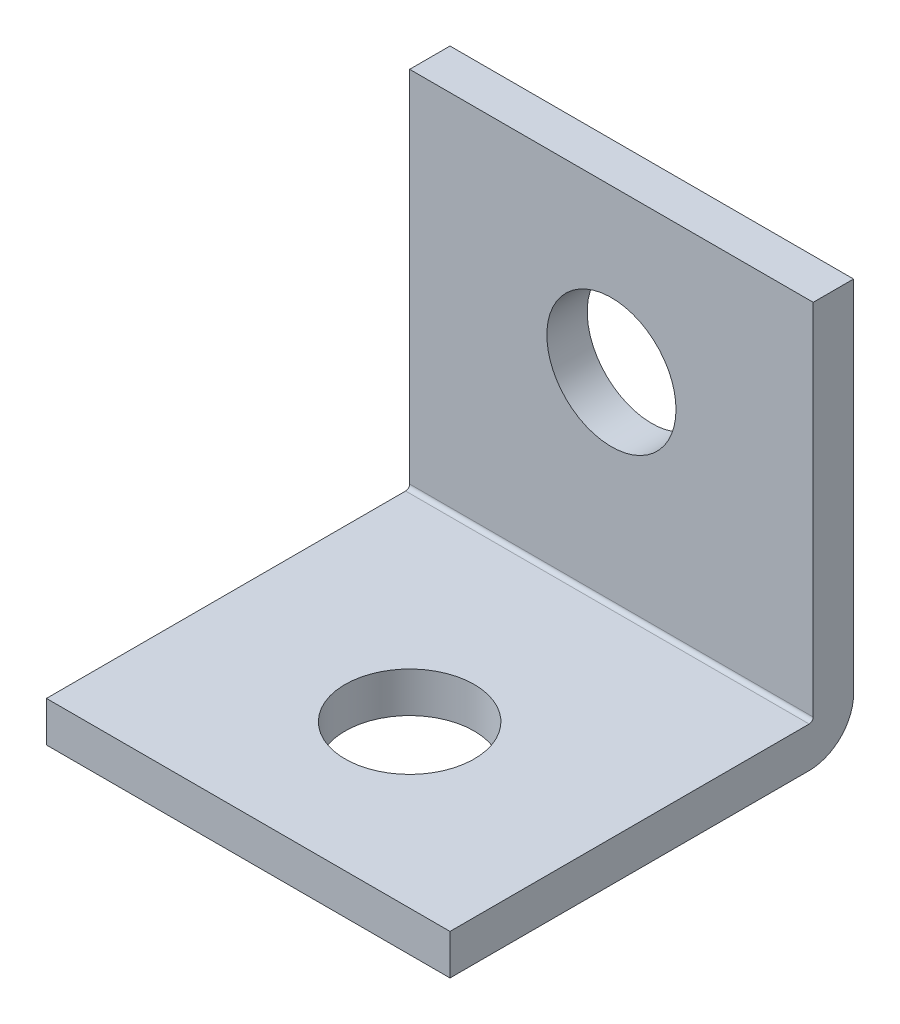
ISO-10303-21;
HEADER;
FILE_DESCRIPTION(('STEP AP214'),'2;1');
FILE_NAME('part.step','',(''),(''),'','','');
FILE_SCHEMA(('AUTOMOTIVE_DESIGN { 1 0 10303 214 1 1 1 1 }'));
ENDSEC;
DATA;
#1=APPLICATION_CONTEXT('core data for automotive mechanical design processes');
#2=APPLICATION_PROTOCOL_DEFINITION('international standard','automotive_design',2000,#1);
#3=PRODUCT_CONTEXT('',#1,'mechanical');
#4=PRODUCT('Part','Part','',(#3));
#5=PRODUCT_RELATED_PRODUCT_CATEGORY('part','',(#4));
#6=PRODUCT_DEFINITION_FORMATION('','',#4);
#7=PRODUCT_DEFINITION_CONTEXT('part definition',#1,'design');
#8=PRODUCT_DEFINITION('design','',#6,#7);
#9=PRODUCT_DEFINITION_SHAPE('','',#8);
#10=(LENGTH_UNIT() NAMED_UNIT(*) SI_UNIT(.MILLI.,.METRE.));
#11=(NAMED_UNIT(*) PLANE_ANGLE_UNIT() SI_UNIT($,.RADIAN.));
#12=(NAMED_UNIT(*) SI_UNIT($,.STERADIAN.) SOLID_ANGLE_UNIT());
#13=UNCERTAINTY_MEASURE_WITH_UNIT(LENGTH_MEASURE(1.E-05),#10,'distance_accuracy_value','');
#14=(GEOMETRIC_REPRESENTATION_CONTEXT(3) GLOBAL_UNCERTAINTY_ASSIGNED_CONTEXT((#13)) GLOBAL_UNIT_ASSIGNED_CONTEXT((#10,
#11,#12)) REPRESENTATION_CONTEXT('',''));
#15=CARTESIAN_POINT('',(0.,0.,0.));
#16=DIRECTION('',(0.,0.,1.));
#17=DIRECTION('',(1.,0.,0.));
#18=AXIS2_PLACEMENT_3D('',#15,#16,#17);
#19=CARTESIAN_POINT('',(0.,-5.,5.12588499176538));
#20=DIRECTION('',(0.,1.,0.));
#21=DIRECTION('',(0.,0.,1.));
#22=AXIS2_PLACEMENT_3D('',#19,#20,#21);
#23=PLANE('',#22);
#24=CARTESIAN_POINT('',(0.,-5.,6.));
#25=DIRECTION('',(0.,-1.,0.));
#26=DIRECTION('',(0.,0.,-1.));
#27=AXIS2_PLACEMENT_3D('',#24,#25,#26);
#28=CIRCLE('',#27,1.6);
#29=CARTESIAN_POINT('',(0.,-5.,4.4));
#30=VERTEX_POINT('',#29);
#31=EDGE_CURVE('E141',#30,#30,#28,.F.);
#32=ORIENTED_EDGE('',*,*,#31,.T.);
#33=EDGE_LOOP('',(#32));
#34=FACE_BOUND('',#33,.T.);
#35=DIRECTION('',(0.,0.,-1.));
#36=VECTOR('',#35,1.);
#37=CARTESIAN_POINT('',(5.,-5.,1.1));
#38=LINE('',#37,#36);
#39=CARTESIAN_POINT('',(4.99999999999999,-5.,10.));
#40=VERTEX_POINT('',#39);
#41=CARTESIAN_POINT('',(5.,-5.,1.1));
#42=VERTEX_POINT('',#41);
#43=EDGE_CURVE('E143',#40,#42,#38,.T.);
#44=ORIENTED_EDGE('',*,*,#43,.F.);
#45=DIRECTION('',(1.,0.,0.));
#46=VECTOR('',#45,1.);
#47=CARTESIAN_POINT('',(-5.,-5.,10.));
#48=LINE('',#47,#46);
#49=CARTESIAN_POINT('',(-5.,-5.,10.));
#50=VERTEX_POINT('',#49);
#51=EDGE_CURVE('E117',#50,#40,#48,.T.);
#52=ORIENTED_EDGE('',*,*,#51,.F.);
#53=DIRECTION('',(0.,0.,1.));
#54=VECTOR('',#53,1.);
#55=CARTESIAN_POINT('',(-5.,-5.,1.1));
#56=LINE('',#55,#54);
#57=CARTESIAN_POINT('',(-5.,-5.,1.1));
#58=VERTEX_POINT('',#57);
#59=EDGE_CURVE('E115',#58,#50,#56,.T.);
#60=ORIENTED_EDGE('',*,*,#59,.F.);
#61=DIRECTION('',(-1.,0.,0.));
#62=VECTOR('',#61,1.);
#63=CARTESIAN_POINT('',(0.,-5.,1.1));
#64=LINE('',#63,#62);
#65=EDGE_CURVE('E140',#42,#58,#64,.T.);
#66=ORIENTED_EDGE('',*,*,#65,.F.);
#67=EDGE_LOOP('',(#44,#52,#60,#66));
#68=FACE_BOUND('',#67,.T.);
#69=ADVANCED_FACE('F16',(#34,#68),#23,.F.);
#70=CARTESIAN_POINT('',(-5.,-4.,10.));
#71=DIRECTION('',(0.,0.,1.));
#72=DIRECTION('',(0.,-1.,0.));
#73=AXIS2_PLACEMENT_3D('',#70,#71,#72);
#74=PLANE('',#73);
#75=DIRECTION('',(1.,0.,0.));
#76=VECTOR('',#75,1.);
#77=CARTESIAN_POINT('',(0.,-4.,10.));
#78=LINE('',#77,#76);
#79=CARTESIAN_POINT('',(-5.,-4.,10.));
#80=VERTEX_POINT('',#79);
#81=CARTESIAN_POINT('',(4.99999999999999,-4.,10.));
#82=VERTEX_POINT('',#81);
#83=EDGE_CURVE('E96',#80,#82,#78,.T.);
#84=ORIENTED_EDGE('',*,*,#83,.F.);
#85=DIRECTION('',(0.,-1.,0.));
#86=VECTOR('',#85,1.);
#87=CARTESIAN_POINT('',(-5.,-4.,10.));
#88=LINE('',#87,#86);
#89=EDGE_CURVE('E92',#80,#50,#88,.T.);
#90=ORIENTED_EDGE('',*,*,#89,.T.);
#91=ORIENTED_EDGE('',*,*,#51,.T.);
#92=DIRECTION('',(0.,1.,0.));
#93=VECTOR('',#92,1.);
#94=CARTESIAN_POINT('',(4.99999999999999,-4.,10.));
#95=LINE('',#94,#93);
#96=EDGE_CURVE('E121',#82,#40,#95,.F.);
#97=ORIENTED_EDGE('',*,*,#96,.F.);
#98=EDGE_LOOP('',(#84,#90,#91,#97));
#99=FACE_BOUND('',#98,.T.);
#100=ADVANCED_FACE('F177',(#99),#74,.T.);
#101=CARTESIAN_POINT('',(0.,-4.,6.));
#102=DIRECTION('',(0.,-1.,0.));
#103=DIRECTION('',(0.,0.,-1.));
#104=AXIS2_PLACEMENT_3D('',#101,#102,#103);
#105=CYLINDRICAL_SURFACE('',#104,1.6);
#106=ORIENTED_EDGE('',*,*,#31,.F.);
#107=EDGE_LOOP('',(#106));
#108=FACE_BOUND('',#107,.T.);
#109=CARTESIAN_POINT('',(0.,-4.,6.));
#110=DIRECTION('',(0.,-1.,0.));
#111=DIRECTION('',(0.,0.,-1.));
#112=AXIS2_PLACEMENT_3D('',#109,#110,#111);
#113=CIRCLE('',#112,1.6);
#114=CARTESIAN_POINT('',(0.,-4.,4.4));
#115=VERTEX_POINT('',#114);
#116=EDGE_CURVE('E109',#115,#115,#113,.T.);
#117=ORIENTED_EDGE('',*,*,#116,.F.);
#118=EDGE_LOOP('',(#117));
#119=FACE_BOUND('',#118,.T.);
#120=ADVANCED_FACE('F223',(#108,#119),#105,.F.);
#121=CARTESIAN_POINT('',(0.,-3.9,1.1));
#122=DIRECTION('',(-1.,0.,0.));
#123=DIRECTION('',(0.,0.,1.));
#124=AXIS2_PLACEMENT_3D('',#121,#122,#123);
#125=CYLINDRICAL_SURFACE('',#124,1.1);
#126=DIRECTION('',(1.,0.,0.));
#127=VECTOR('',#126,1.);
#128=CARTESIAN_POINT('',(0.,-3.9,0.));
#129=LINE('',#128,#127);
#130=CARTESIAN_POINT('',(-5.,-3.9,0.));
#131=VERTEX_POINT('',#130);
#132=CARTESIAN_POINT('',(5.,-3.9,0.));
#133=VERTEX_POINT('',#132);
#134=EDGE_CURVE('E104',#131,#133,#129,.T.);
#135=ORIENTED_EDGE('',*,*,#134,.T.);
#136=CARTESIAN_POINT('',(5.,-3.9,1.1));
#137=DIRECTION('',(-1.,0.,0.));
#138=DIRECTION('',(0.,0.,1.));
#139=AXIS2_PLACEMENT_3D('',#136,#137,#138);
#140=CIRCLE('',#139,1.1);
#141=EDGE_CURVE('E97',#133,#42,#140,.T.);
#142=ORIENTED_EDGE('',*,*,#141,.T.);
#143=ORIENTED_EDGE('',*,*,#65,.T.);
#144=CARTESIAN_POINT('',(-5.,-3.9,1.1));
#145=DIRECTION('',(-1.,0.,0.));
#146=DIRECTION('',(0.,0.,1.));
#147=AXIS2_PLACEMENT_3D('',#144,#145,#146);
#148=CIRCLE('',#147,1.1);
#149=EDGE_CURVE('E138',#58,#131,#148,.F.);
#150=ORIENTED_EDGE('',*,*,#149,.T.);
#151=EDGE_LOOP('',(#135,#142,#143,#150));
#152=FACE_BOUND('',#151,.T.);
#153=ADVANCED_FACE('F182',(#152),#125,.T.);
#154=CARTESIAN_POINT('',(0.,-4.,5.12588499176538));
#155=DIRECTION('',(0.,1.,0.));
#156=DIRECTION('',(0.,0.,1.));
#157=AXIS2_PLACEMENT_3D('',#154,#155,#156);
#158=PLANE('',#157);
#159=ORIENTED_EDGE('',*,*,#116,.T.);
#160=EDGE_LOOP('',(#159));
#161=FACE_BOUND('',#160,.T.);
#162=ORIENTED_EDGE('',*,*,#83,.T.);
#163=DIRECTION('',(0.,0.,1.));
#164=VECTOR('',#163,1.);
#165=CARTESIAN_POINT('',(5.,-4.,5.12588499176538));
#166=LINE('',#165,#164);
#167=CARTESIAN_POINT('',(5.,-4.,1.1));
#168=VERTEX_POINT('',#167);
#169=EDGE_CURVE('E102',#82,#168,#166,.F.);
#170=ORIENTED_EDGE('',*,*,#169,.T.);
#171=DIRECTION('',(-1.,0.,0.));
#172=VECTOR('',#171,1.);
#173=CARTESIAN_POINT('',(0.,-4.,1.1));
#174=LINE('',#173,#172);
#175=CARTESIAN_POINT('',(-5.,-4.,1.1));
#176=VERTEX_POINT('',#175);
#177=EDGE_CURVE('E82',#168,#176,#174,.T.);
#178=ORIENTED_EDGE('',*,*,#177,.T.);
#179=DIRECTION('',(0.,0.,1.));
#180=VECTOR('',#179,1.);
#181=CARTESIAN_POINT('',(-5.,-4.,5.12588499176538));
#182=LINE('',#181,#180);
#183=EDGE_CURVE('E88',#176,#80,#182,.T.);
#184=ORIENTED_EDGE('',*,*,#183,.T.);
#185=EDGE_LOOP('',(#162,#170,#178,#184));
#186=FACE_BOUND('',#185,.T.);
#187=ADVANCED_FACE('F100',(#161,#186),#158,.T.);
#188=CARTESIAN_POINT('',(0.,0.,0.));
#189=DIRECTION('',(0.,0.,1.));
#190=DIRECTION('',(1.,0.,0.));
#191=AXIS2_PLACEMENT_3D('',#188,#189,#190);
#192=PLANE('',#191);
#193=CARTESIAN_POINT('',(0.,1.,0.));
#194=DIRECTION('',(0.,0.,1.));
#195=DIRECTION('',(1.,0.,0.));
#196=AXIS2_PLACEMENT_3D('',#193,#194,#195);
#197=CIRCLE('',#196,1.6);
#198=CARTESIAN_POINT('',(1.6,1.,0.));
#199=VERTEX_POINT('',#198);
#200=EDGE_CURVE('E129',#199,#199,#197,.T.);
#201=ORIENTED_EDGE('',*,*,#200,.T.);
#202=EDGE_LOOP('',(#201));
#203=FACE_BOUND('',#202,.T.);
#204=DIRECTION('',(0.,-1.,0.));
#205=VECTOR('',#204,1.);
#206=CARTESIAN_POINT('',(-5.,-5.,0.));
#207=LINE('',#206,#205);
#208=CARTESIAN_POINT('',(-5.,5.,0.));
#209=VERTEX_POINT('',#208);
#210=EDGE_CURVE('E134',#209,#131,#207,.T.);
#211=ORIENTED_EDGE('',*,*,#210,.F.);
#212=DIRECTION('',(1.,0.,0.));
#213=VECTOR('',#212,1.);
#214=CARTESIAN_POINT('',(-5.,5.,0.));
#215=LINE('',#214,#213);
#216=CARTESIAN_POINT('',(5.,5.,0.));
#217=VERTEX_POINT('',#216);
#218=EDGE_CURVE('E154',#217,#209,#215,.F.);
#219=ORIENTED_EDGE('',*,*,#218,.F.);
#220=DIRECTION('',(0.,1.,0.));
#221=VECTOR('',#220,1.);
#222=CARTESIAN_POINT('',(5.,5.,0.));
#223=LINE('',#222,#221);
#224=EDGE_CURVE('E103',#133,#217,#223,.T.);
#225=ORIENTED_EDGE('',*,*,#224,.F.);
#226=ORIENTED_EDGE('',*,*,#134,.F.);
#227=EDGE_LOOP('',(#211,#219,#225,#226));
#228=FACE_BOUND('',#227,.T.);
#229=ADVANCED_FACE('F187',(#203,#228),#192,.F.);
#230=CARTESIAN_POINT('',(0.,-3.9,1.1));
#231=DIRECTION('',(-1.,0.,0.));
#232=DIRECTION('',(0.,0.,1.));
#233=AXIS2_PLACEMENT_3D('',#230,#231,#232);
#234=CYLINDRICAL_SURFACE('',#233,0.1);
#235=CARTESIAN_POINT('',(5.,-3.9,1.1));
#236=DIRECTION('',(-1.,0.,0.));
#237=DIRECTION('',(0.,0.,1.));
#238=AXIS2_PLACEMENT_3D('',#235,#236,#237);
#239=CIRCLE('',#238,0.1);
#240=CARTESIAN_POINT('',(5.,-3.9,1.));
#241=VERTEX_POINT('',#240);
#242=EDGE_CURVE('E86',#241,#168,#239,.T.);
#243=ORIENTED_EDGE('',*,*,#242,.F.);
#244=DIRECTION('',(1.,0.,0.));
#245=VECTOR('',#244,1.);
#246=CARTESIAN_POINT('',(0.,-3.9,1.));
#247=LINE('',#246,#245);
#248=CARTESIAN_POINT('',(-5.,-3.9,1.));
#249=VERTEX_POINT('',#248);
#250=EDGE_CURVE('E84',#249,#241,#247,.T.);
#251=ORIENTED_EDGE('',*,*,#250,.F.);
#252=CARTESIAN_POINT('',(-5.,-3.9,1.1));
#253=DIRECTION('',(-1.,0.,0.));
#254=DIRECTION('',(0.,0.,1.));
#255=AXIS2_PLACEMENT_3D('',#252,#253,#254);
#256=CIRCLE('',#255,0.1);
#257=EDGE_CURVE('E19',#176,#249,#256,.F.);
#258=ORIENTED_EDGE('',*,*,#257,.F.);
#259=ORIENTED_EDGE('',*,*,#177,.F.);
#260=EDGE_LOOP('',(#243,#251,#258,#259));
#261=FACE_BOUND('',#260,.T.);
#262=ADVANCED_FACE('F80',(#261),#234,.F.);
#263=CARTESIAN_POINT('',(5.,5.,0.));
#264=DIRECTION('',(1.,0.,0.));
#265=DIRECTION('',(0.,1.,0.));
#266=AXIS2_PLACEMENT_3D('',#263,#264,#265);
#267=PLANE('',#266);
#268=DIRECTION('',(0.,0.,1.));
#269=VECTOR('',#268,1.);
#270=CARTESIAN_POINT('',(5.,5.,0.));
#271=LINE('',#270,#269);
#272=CARTESIAN_POINT('',(5.,5.,1.));
#273=VERTEX_POINT('',#272);
#274=EDGE_CURVE('E106',#273,#217,#271,.F.);
#275=ORIENTED_EDGE('',*,*,#274,.F.);
#276=DIRECTION('',(0.,1.,0.));
#277=VECTOR('',#276,1.);
#278=CARTESIAN_POINT('',(5.,0.,1.));
#279=LINE('',#278,#277);
#280=EDGE_CURVE('E124',#241,#273,#279,.T.);
#281=ORIENTED_EDGE('',*,*,#280,.F.);
#282=ORIENTED_EDGE('',*,*,#242,.T.);
#283=ORIENTED_EDGE('',*,*,#169,.F.);
#284=ORIENTED_EDGE('',*,*,#96,.T.);
#285=ORIENTED_EDGE('',*,*,#43,.T.);
#286=ORIENTED_EDGE('',*,*,#141,.F.);
#287=ORIENTED_EDGE('',*,*,#224,.T.);
#288=EDGE_LOOP('',(#275,#281,#282,#283,#284,#285,#286,#287));
#289=FACE_BOUND('',#288,.T.);
#290=ADVANCED_FACE('F146',(#289),#267,.T.);
#291=CARTESIAN_POINT('',(-5.,5.,0.));
#292=DIRECTION('',(0.,1.,0.));
#293=DIRECTION('',(0.,0.,1.));
#294=AXIS2_PLACEMENT_3D('',#291,#292,#293);
#295=PLANE('',#294);
#296=ORIENTED_EDGE('',*,*,#218,.T.);
#297=DIRECTION('',(0.,0.,1.));
#298=VECTOR('',#297,1.);
#299=CARTESIAN_POINT('',(-5.,5.,0.));
#300=LINE('',#299,#298);
#301=CARTESIAN_POINT('',(-5.,5.,1.));
#302=VERTEX_POINT('',#301);
#303=EDGE_CURVE('E34',#302,#209,#300,.F.);
#304=ORIENTED_EDGE('',*,*,#303,.F.);
#305=DIRECTION('',(1.,0.,0.));
#306=VECTOR('',#305,1.);
#307=CARTESIAN_POINT('',(0.,5.,1.));
#308=LINE('',#307,#306);
#309=EDGE_CURVE('E127',#273,#302,#308,.F.);
#310=ORIENTED_EDGE('',*,*,#309,.F.);
#311=ORIENTED_EDGE('',*,*,#274,.T.);
#312=EDGE_LOOP('',(#296,#304,#310,#311));
#313=FACE_BOUND('',#312,.T.);
#314=ADVANCED_FACE('F188',(#313),#295,.T.);
#315=CARTESIAN_POINT('',(-5.,-5.,0.));
#316=DIRECTION('',(-1.,0.,0.));
#317=DIRECTION('',(0.,-1.,0.));
#318=AXIS2_PLACEMENT_3D('',#315,#316,#317);
#319=PLANE('',#318);
#320=ORIENTED_EDGE('',*,*,#303,.T.);
#321=ORIENTED_EDGE('',*,*,#210,.T.);
#322=ORIENTED_EDGE('',*,*,#149,.F.);
#323=ORIENTED_EDGE('',*,*,#59,.T.);
#324=ORIENTED_EDGE('',*,*,#89,.F.);
#325=ORIENTED_EDGE('',*,*,#183,.F.);
#326=ORIENTED_EDGE('',*,*,#257,.T.);
#327=DIRECTION('',(0.,1.,0.));
#328=VECTOR('',#327,1.);
#329=CARTESIAN_POINT('',(-5.,0.,1.));
#330=LINE('',#329,#328);
#331=EDGE_CURVE('E25',#302,#249,#330,.F.);
#332=ORIENTED_EDGE('',*,*,#331,.F.);
#333=EDGE_LOOP('',(#320,#321,#322,#323,#324,#325,#326,#332));
#334=FACE_BOUND('',#333,.T.);
#335=ADVANCED_FACE('F89',(#334),#319,.T.);
#336=CARTESIAN_POINT('',(0.,1.,0.));
#337=DIRECTION('',(0.,0.,1.));
#338=DIRECTION('',(1.,0.,0.));
#339=AXIS2_PLACEMENT_3D('',#336,#337,#338);
#340=CYLINDRICAL_SURFACE('',#339,1.6);
#341=CARTESIAN_POINT('',(0.,1.,1.));
#342=DIRECTION('',(0.,0.,1.));
#343=DIRECTION('',(1.,0.,0.));
#344=AXIS2_PLACEMENT_3D('',#341,#342,#343);
#345=CIRCLE('',#344,1.6);
#346=CARTESIAN_POINT('',(1.6,1.,1.));
#347=VERTEX_POINT('',#346);
#348=EDGE_CURVE('E11',#347,#347,#345,.F.);
#349=ORIENTED_EDGE('',*,*,#348,.F.);
#350=EDGE_LOOP('',(#349));
#351=FACE_BOUND('',#350,.T.);
#352=ORIENTED_EDGE('',*,*,#200,.F.);
#353=EDGE_LOOP('',(#352));
#354=FACE_BOUND('',#353,.T.);
#355=ADVANCED_FACE('F196',(#351,#354),#340,.F.);
#356=CARTESIAN_POINT('',(0.,0.,1.));
#357=DIRECTION('',(0.,0.,1.));
#358=DIRECTION('',(1.,0.,0.));
#359=AXIS2_PLACEMENT_3D('',#356,#357,#358);
#360=PLANE('',#359);
#361=ORIENTED_EDGE('',*,*,#348,.T.);
#362=EDGE_LOOP('',(#361));
#363=FACE_BOUND('',#362,.T.);
#364=ORIENTED_EDGE('',*,*,#309,.T.);
#365=ORIENTED_EDGE('',*,*,#331,.T.);
#366=ORIENTED_EDGE('',*,*,#250,.T.);
#367=ORIENTED_EDGE('',*,*,#280,.T.);
#368=EDGE_LOOP('',(#364,#365,#366,#367));
#369=FACE_BOUND('',#368,.T.);
#370=ADVANCED_FACE('F150',(#363,#369),#360,.T.);
#371=CLOSED_SHELL('',(#69,#100,#120,#153,#187,#229,#262,#290,#314,#335,#355,#370));
#372=MANIFOLD_SOLID_BREP('B1',#371);
#373=ADVANCED_BREP_SHAPE_REPRESENTATION('',(#18,#372),#14);
#374=SHAPE_DEFINITION_REPRESENTATION(#9,#373);
ENDSEC;
END-ISO-10303-21;
